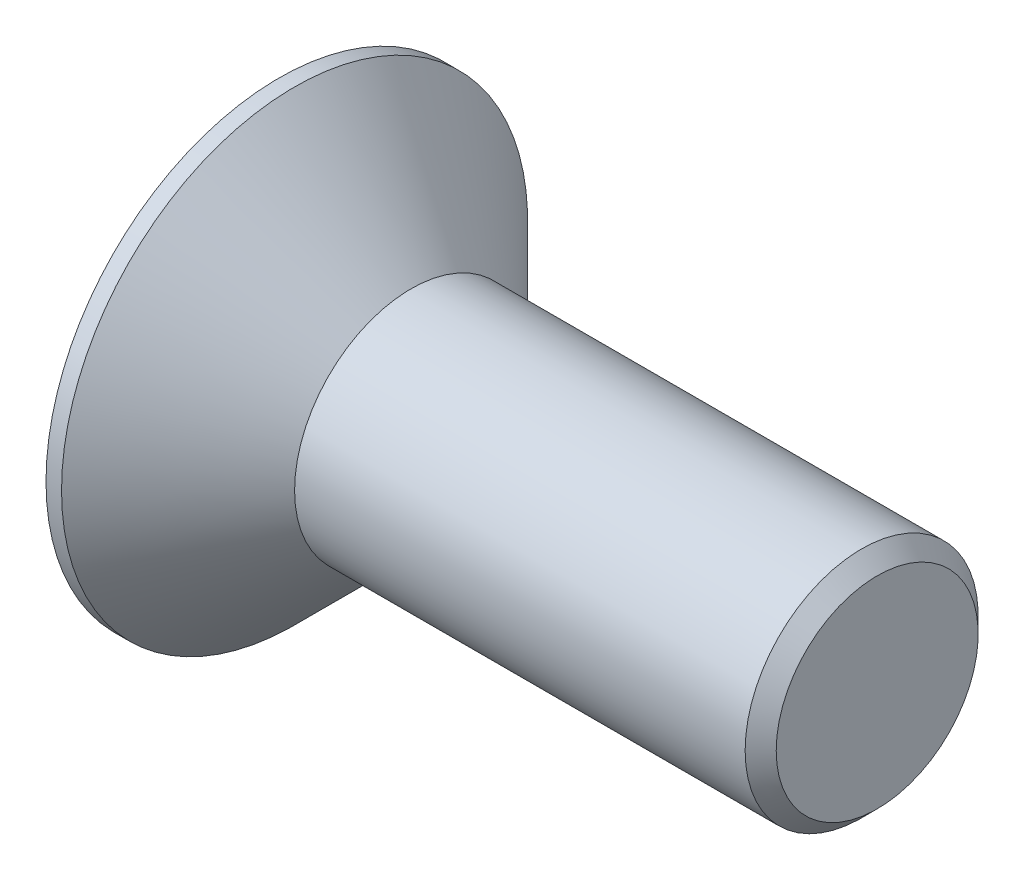
ISO-10303-21;
HEADER;
FILE_DESCRIPTION(('STEP AP214'),'2;1');
FILE_NAME('part.step','',(''),(''),'','','');
FILE_SCHEMA(('AUTOMOTIVE_DESIGN { 1 0 10303 214 1 1 1 1 }'));
ENDSEC;
DATA;
#1=APPLICATION_CONTEXT('core data for automotive mechanical design processes');
#2=APPLICATION_PROTOCOL_DEFINITION('international standard','automotive_design',2000,#1);
#3=PRODUCT_CONTEXT('',#1,'mechanical');
#4=PRODUCT('Part','Part','',(#3));
#5=PRODUCT_RELATED_PRODUCT_CATEGORY('part','',(#4));
#6=PRODUCT_DEFINITION_FORMATION('','',#4);
#7=PRODUCT_DEFINITION_CONTEXT('part definition',#1,'design');
#8=PRODUCT_DEFINITION('design','',#6,#7);
#9=PRODUCT_DEFINITION_SHAPE('','',#8);
#10=(LENGTH_UNIT() NAMED_UNIT(*) SI_UNIT(.MILLI.,.METRE.));
#11=(NAMED_UNIT(*) PLANE_ANGLE_UNIT() SI_UNIT($,.RADIAN.));
#12=(NAMED_UNIT(*) SI_UNIT($,.STERADIAN.) SOLID_ANGLE_UNIT());
#13=UNCERTAINTY_MEASURE_WITH_UNIT(LENGTH_MEASURE(1.E-05),#10,'distance_accuracy_value','');
#14=(GEOMETRIC_REPRESENTATION_CONTEXT(3) GLOBAL_UNCERTAINTY_ASSIGNED_CONTEXT((#13)) GLOBAL_UNIT_ASSIGNED_CONTEXT((#10,
#11,#12)) REPRESENTATION_CONTEXT('',''));
#15=CARTESIAN_POINT('',(0.,0.,0.));
#16=DIRECTION('',(0.,0.,1.));
#17=DIRECTION('',(1.,0.,0.));
#18=AXIS2_PLACEMENT_3D('',#15,#16,#17);
#19=CARTESIAN_POINT('',(0.,0.,0.));
#20=DIRECTION('',(1.,0.,0.));
#21=DIRECTION('',(0.,0.,-1.));
#22=AXIS2_PLACEMENT_3D('',#19,#20,#21);
#23=PLANE('',#22);
#24=DIRECTION('',(0.,0.866025403784439,0.5));
#25=VECTOR('',#24,1.);
#26=CARTESIAN_POINT('',(0.,-0.75,0.433012701892219));
#27=LINE('',#26,#25);
#28=CARTESIAN_POINT('',(0.,-0.75,0.433012701892219));
#29=VERTEX_POINT('',#28);
#30=CARTESIAN_POINT('',(0.,0.,0.866025403784438));
#31=VERTEX_POINT('',#30);
#32=EDGE_CURVE('E121',#29,#31,#27,.T.);
#33=ORIENTED_EDGE('',*,*,#32,.F.);
#34=DIRECTION('',(0.,0.,1.));
#35=VECTOR('',#34,1.);
#36=CARTESIAN_POINT('',(0.,-0.75,-0.433012701892219));
#37=LINE('',#36,#35);
#38=CARTESIAN_POINT('',(0.,-0.75,-0.433012701892219));
#39=VERTEX_POINT('',#38);
#40=EDGE_CURVE('E47',#39,#29,#37,.T.);
#41=ORIENTED_EDGE('',*,*,#40,.F.);
#42=DIRECTION('',(0.,-0.866025403784438,0.5));
#43=VECTOR('',#42,1.);
#44=CARTESIAN_POINT('',(0.,0.,-0.866025403784439));
#45=LINE('',#44,#43);
#46=CARTESIAN_POINT('',(0.,0.,-0.866025403784439));
#47=VERTEX_POINT('',#46);
#48=EDGE_CURVE('E130',#47,#39,#45,.T.);
#49=ORIENTED_EDGE('',*,*,#48,.F.);
#50=DIRECTION('',(0.,-0.866025403784438,-0.5));
#51=VECTOR('',#50,1.);
#52=CARTESIAN_POINT('',(0.,0.75,-0.433012701892219));
#53=LINE('',#52,#51);
#54=CARTESIAN_POINT('',(0.,0.75,-0.433012701892219));
#55=VERTEX_POINT('',#54);
#56=EDGE_CURVE('E128',#55,#47,#53,.T.);
#57=ORIENTED_EDGE('',*,*,#56,.F.);
#58=DIRECTION('',(0.,0.,-1.));
#59=VECTOR('',#58,1.);
#60=CARTESIAN_POINT('',(0.,0.75,0.433012701892219));
#61=LINE('',#60,#59);
#62=CARTESIAN_POINT('',(0.,0.75,0.433012701892219));
#63=VERTEX_POINT('',#62);
#64=EDGE_CURVE('E95',#63,#55,#61,.T.);
#65=ORIENTED_EDGE('',*,*,#64,.F.);
#66=DIRECTION('',(0.,0.866025403784438,-0.5));
#67=VECTOR('',#66,1.);
#68=CARTESIAN_POINT('',(0.,0.,0.866025403784438));
#69=LINE('',#68,#67);
#70=EDGE_CURVE('E124',#31,#63,#69,.T.);
#71=ORIENTED_EDGE('',*,*,#70,.F.);
#72=EDGE_LOOP('',(#33,#41,#49,#57,#65,#71));
#73=FACE_BOUND('',#72,.T.);
#74=CARTESIAN_POINT('',(0.,0.,0.));
#75=DIRECTION('',(-1.,0.,0.));
#76=DIRECTION('',(0.,0.,1.));
#77=AXIS2_PLACEMENT_3D('',#74,#75,#76);
#78=CIRCLE('',#77,3.);
#79=CARTESIAN_POINT('',(0.,0.,3.));
#80=VERTEX_POINT('',#79);
#81=EDGE_CURVE('E145',#80,#80,#78,.T.);
#82=ORIENTED_EDGE('',*,*,#81,.T.);
#83=EDGE_LOOP('',(#82));
#84=FACE_BOUND('',#83,.T.);
#85=ADVANCED_FACE('F32',(#73,#84),#23,.F.);
#86=CARTESIAN_POINT('',(0.,0.,0.));
#87=DIRECTION('',(-1.,0.,0.));
#88=DIRECTION('',(0.,0.,1.));
#89=AXIS2_PLACEMENT_3D('',#86,#87,#88);
#90=CYLINDRICAL_SURFACE('',#89,3.);
#91=ORIENTED_EDGE('',*,*,#81,.F.);
#92=EDGE_LOOP('',(#91));
#93=FACE_BOUND('',#92,.T.);
#94=CARTESIAN_POINT('',(0.2,0.,0.));
#95=DIRECTION('',(-1.,0.,0.));
#96=DIRECTION('',(0.,0.,1.));
#97=AXIS2_PLACEMENT_3D('',#94,#95,#96);
#98=CIRCLE('',#97,3.);
#99=CARTESIAN_POINT('',(0.2,0.,3.));
#100=VERTEX_POINT('',#99);
#101=EDGE_CURVE('E142',#100,#100,#98,.T.);
#102=ORIENTED_EDGE('',*,*,#101,.T.);
#103=EDGE_LOOP('',(#102));
#104=FACE_BOUND('',#103,.T.);
#105=ADVANCED_FACE('F162',(#93,#104),#90,.T.);
#106=CARTESIAN_POINT('',(1.69999999999999,0.,0.));
#107=DIRECTION('',(-1.,0.,0.));
#108=DIRECTION('',(0.,0.,1.));
#109=AXIS2_PLACEMENT_3D('',#106,#107,#108);
#110=CONICAL_SURFACE('',#109,1.5,0.785398163397453);
#111=ORIENTED_EDGE('',*,*,#101,.F.);
#112=EDGE_LOOP('',(#111));
#113=FACE_BOUND('',#112,.T.);
#114=CARTESIAN_POINT('',(1.69999999999999,0.,0.));
#115=DIRECTION('',(-1.,0.,0.));
#116=DIRECTION('',(0.,0.,1.));
#117=AXIS2_PLACEMENT_3D('',#114,#115,#116);
#118=CIRCLE('',#117,1.5);
#119=CARTESIAN_POINT('',(1.69999999999999,0.,1.5));
#120=VERTEX_POINT('',#119);
#121=EDGE_CURVE('E134',#120,#120,#118,.T.);
#122=ORIENTED_EDGE('',*,*,#121,.T.);
#123=EDGE_LOOP('',(#122));
#124=FACE_BOUND('',#123,.T.);
#125=ADVANCED_FACE('F167',(#113,#124),#110,.T.);
#126=CARTESIAN_POINT('',(0.,0.,0.));
#127=DIRECTION('',(-1.,0.,0.));
#128=DIRECTION('',(0.,0.,1.));
#129=AXIS2_PLACEMENT_3D('',#126,#127,#128);
#130=CYLINDRICAL_SURFACE('',#129,1.5);
#131=CARTESIAN_POINT('',(7.49999999999999,0.,0.));
#132=DIRECTION('',(-1.,0.,0.));
#133=DIRECTION('',(0.,0.,1.));
#134=AXIS2_PLACEMENT_3D('',#131,#132,#133);
#135=CIRCLE('',#134,1.5);
#136=CARTESIAN_POINT('',(7.49999999999999,0.,1.5));
#137=VERTEX_POINT('',#136);
#138=EDGE_CURVE('E40',#137,#137,#135,.T.);
#139=ORIENTED_EDGE('',*,*,#138,.T.);
#140=EDGE_LOOP('',(#139));
#141=FACE_BOUND('',#140,.T.);
#142=ORIENTED_EDGE('',*,*,#121,.F.);
#143=EDGE_LOOP('',(#142));
#144=FACE_BOUND('',#143,.T.);
#145=ADVANCED_FACE('F150',(#141,#144),#130,.T.);
#146=CARTESIAN_POINT('',(7.69999999999999,1.5,0.));
#147=DIRECTION('',(-1.,0.,0.));
#148=DIRECTION('',(0.,0.,1.));
#149=AXIS2_PLACEMENT_3D('',#146,#147,#148);
#150=PLANE('',#149);
#151=CARTESIAN_POINT('',(7.69999999999999,0.,0.));
#152=DIRECTION('',(-1.,0.,0.));
#153=DIRECTION('',(0.,0.,1.));
#154=AXIS2_PLACEMENT_3D('',#151,#152,#153);
#155=CIRCLE('',#154,1.3);
#156=CARTESIAN_POINT('',(7.69999999999999,0.,1.3));
#157=VERTEX_POINT('',#156);
#158=EDGE_CURVE('E11',#157,#157,#155,.F.);
#159=ORIENTED_EDGE('',*,*,#158,.T.);
#160=EDGE_LOOP('',(#159));
#161=FACE_BOUND('',#160,.T.);
#162=ADVANCED_FACE('F178',(#161),#150,.F.);
#163=CARTESIAN_POINT('',(2.,-0.75,-0.433012701892219));
#164=DIRECTION('',(0.,-1.,0.));
#165=DIRECTION('',(0.,0.,-1.));
#166=AXIS2_PLACEMENT_3D('',#163,#164,#165);
#167=PLANE('',#166);
#168=ORIENTED_EDGE('',*,*,#40,.T.);
#169=DIRECTION('',(-1.,0.,0.));
#170=VECTOR('',#169,1.);
#171=CARTESIAN_POINT('',(2.,-0.75,0.433012701892219));
#172=LINE('',#171,#170);
#173=CARTESIAN_POINT('',(2.,-0.75,0.433012701892219));
#174=VERTEX_POINT('',#173);
#175=EDGE_CURVE('E77',#174,#29,#172,.T.);
#176=ORIENTED_EDGE('',*,*,#175,.F.);
#177=DIRECTION('',(0.,0.,1.));
#178=VECTOR('',#177,1.);
#179=CARTESIAN_POINT('',(2.,-0.75,-0.433012701892219));
#180=LINE('',#179,#178);
#181=CARTESIAN_POINT('',(2.,-0.75,-0.433012701892219));
#182=VERTEX_POINT('',#181);
#183=EDGE_CURVE('E132',#182,#174,#180,.T.);
#184=ORIENTED_EDGE('',*,*,#183,.F.);
#185=DIRECTION('',(-1.,0.,0.));
#186=VECTOR('',#185,1.);
#187=CARTESIAN_POINT('',(2.,-0.75,-0.433012701892219));
#188=LINE('',#187,#186);
#189=EDGE_CURVE('E55',#182,#39,#188,.T.);
#190=ORIENTED_EDGE('',*,*,#189,.T.);
#191=EDGE_LOOP('',(#168,#176,#184,#190));
#192=FACE_BOUND('',#191,.T.);
#193=ADVANCED_FACE('F181',(#192),#167,.F.);
#194=CARTESIAN_POINT('',(2.,0.,-0.866025403784439));
#195=DIRECTION('',(0.,-0.5,-0.866025403784438));
#196=DIRECTION('',(0.,0.866025403784439,-0.5));
#197=AXIS2_PLACEMENT_3D('',#194,#195,#196);
#198=PLANE('',#197);
#199=ORIENTED_EDGE('',*,*,#48,.T.);
#200=ORIENTED_EDGE('',*,*,#189,.F.);
#201=DIRECTION('',(0.,-0.866025403784438,0.5));
#202=VECTOR('',#201,1.);
#203=CARTESIAN_POINT('',(2.,0.,-0.866025403784439));
#204=LINE('',#203,#202);
#205=CARTESIAN_POINT('',(2.,0.,-0.866025403784439));
#206=VERTEX_POINT('',#205);
#207=EDGE_CURVE('E107',#206,#182,#204,.T.);
#208=ORIENTED_EDGE('',*,*,#207,.F.);
#209=DIRECTION('',(-1.,0.,0.));
#210=VECTOR('',#209,1.);
#211=CARTESIAN_POINT('',(2.,0.,-0.866025403784439));
#212=LINE('',#211,#210);
#213=EDGE_CURVE('E99',#206,#47,#212,.T.);
#214=ORIENTED_EDGE('',*,*,#213,.T.);
#215=EDGE_LOOP('',(#199,#200,#208,#214));
#216=FACE_BOUND('',#215,.T.);
#217=ADVANCED_FACE('F185',(#216),#198,.F.);
#218=CARTESIAN_POINT('',(2.,0.75,-0.433012701892219));
#219=DIRECTION('',(0.,0.5,-0.866025403784439));
#220=DIRECTION('',(0.,0.866025403784438,0.5));
#221=AXIS2_PLACEMENT_3D('',#218,#219,#220);
#222=PLANE('',#221);
#223=ORIENTED_EDGE('',*,*,#56,.T.);
#224=ORIENTED_EDGE('',*,*,#213,.F.);
#225=DIRECTION('',(0.,-0.866025403784438,-0.5));
#226=VECTOR('',#225,1.);
#227=CARTESIAN_POINT('',(2.,0.75,-0.433012701892219));
#228=LINE('',#227,#226);
#229=CARTESIAN_POINT('',(2.,0.75,-0.433012701892219));
#230=VERTEX_POINT('',#229);
#231=EDGE_CURVE('E103',#230,#206,#228,.T.);
#232=ORIENTED_EDGE('',*,*,#231,.F.);
#233=DIRECTION('',(-1.,0.,0.));
#234=VECTOR('',#233,1.);
#235=CARTESIAN_POINT('',(2.,0.75,-0.433012701892219));
#236=LINE('',#235,#234);
#237=EDGE_CURVE('E88',#230,#55,#236,.T.);
#238=ORIENTED_EDGE('',*,*,#237,.T.);
#239=EDGE_LOOP('',(#223,#224,#232,#238));
#240=FACE_BOUND('',#239,.T.);
#241=ADVANCED_FACE('F104',(#240),#222,.F.);
#242=CARTESIAN_POINT('',(2.,0.75,0.433012701892219));
#243=DIRECTION('',(0.,1.,0.));
#244=DIRECTION('',(0.,0.,1.));
#245=AXIS2_PLACEMENT_3D('',#242,#243,#244);
#246=PLANE('',#245);
#247=ORIENTED_EDGE('',*,*,#64,.T.);
#248=ORIENTED_EDGE('',*,*,#237,.F.);
#249=DIRECTION('',(0.,0.,-1.));
#250=VECTOR('',#249,1.);
#251=CARTESIAN_POINT('',(2.,0.75,0.433012701892219));
#252=LINE('',#251,#250);
#253=CARTESIAN_POINT('',(2.,0.75,0.433012701892219));
#254=VERTEX_POINT('',#253);
#255=EDGE_CURVE('E92',#254,#230,#252,.T.);
#256=ORIENTED_EDGE('',*,*,#255,.F.);
#257=DIRECTION('',(-1.,0.,0.));
#258=VECTOR('',#257,1.);
#259=CARTESIAN_POINT('',(2.,0.75,0.433012701892219));
#260=LINE('',#259,#258);
#261=EDGE_CURVE('E100',#254,#63,#260,.T.);
#262=ORIENTED_EDGE('',*,*,#261,.T.);
#263=EDGE_LOOP('',(#247,#248,#256,#262));
#264=FACE_BOUND('',#263,.T.);
#265=ADVANCED_FACE('F90',(#264),#246,.F.);
#266=CARTESIAN_POINT('',(2.,0.,0.866025403784438));
#267=DIRECTION('',(0.,0.5,0.866025403784439));
#268=DIRECTION('',(0.,-0.866025403784438,0.5));
#269=AXIS2_PLACEMENT_3D('',#266,#267,#268);
#270=PLANE('',#269);
#271=ORIENTED_EDGE('',*,*,#70,.T.);
#272=ORIENTED_EDGE('',*,*,#261,.F.);
#273=DIRECTION('',(0.,0.866025403784438,-0.5));
#274=VECTOR('',#273,1.);
#275=CARTESIAN_POINT('',(2.,0.,0.866025403784438));
#276=LINE('',#275,#274);
#277=CARTESIAN_POINT('',(2.,0.,0.866025403784438));
#278=VERTEX_POINT('',#277);
#279=EDGE_CURVE('E113',#278,#254,#276,.T.);
#280=ORIENTED_EDGE('',*,*,#279,.F.);
#281=DIRECTION('',(-1.,0.,0.));
#282=VECTOR('',#281,1.);
#283=CARTESIAN_POINT('',(2.,0.,0.866025403784438));
#284=LINE('',#283,#282);
#285=EDGE_CURVE('E137',#278,#31,#284,.T.);
#286=ORIENTED_EDGE('',*,*,#285,.T.);
#287=EDGE_LOOP('',(#271,#272,#280,#286));
#288=FACE_BOUND('',#287,.T.);
#289=ADVANCED_FACE('F188',(#288),#270,.F.);
#290=CARTESIAN_POINT('',(2.,-0.75,0.433012701892219));
#291=DIRECTION('',(0.,-0.5,0.866025403784439));
#292=DIRECTION('',(0.,-0.866025403784439,-0.5));
#293=AXIS2_PLACEMENT_3D('',#290,#291,#292);
#294=PLANE('',#293);
#295=ORIENTED_EDGE('',*,*,#32,.T.);
#296=ORIENTED_EDGE('',*,*,#285,.F.);
#297=DIRECTION('',(0.,0.866025403784439,0.5));
#298=VECTOR('',#297,1.);
#299=CARTESIAN_POINT('',(2.,-0.75,0.433012701892219));
#300=LINE('',#299,#298);
#301=EDGE_CURVE('E115',#174,#278,#300,.T.);
#302=ORIENTED_EDGE('',*,*,#301,.F.);
#303=ORIENTED_EDGE('',*,*,#175,.T.);
#304=EDGE_LOOP('',(#295,#296,#302,#303));
#305=FACE_BOUND('',#304,.T.);
#306=ADVANCED_FACE('F158',(#305),#294,.F.);
#307=CARTESIAN_POINT('',(2.,0.,0.));
#308=DIRECTION('',(-1.,0.,0.));
#309=DIRECTION('',(0.,0.,1.));
#310=AXIS2_PLACEMENT_3D('',#307,#308,#309);
#311=PLANE('',#310);
#312=ORIENTED_EDGE('',*,*,#183,.T.);
#313=ORIENTED_EDGE('',*,*,#301,.T.);
#314=ORIENTED_EDGE('',*,*,#279,.T.);
#315=ORIENTED_EDGE('',*,*,#255,.T.);
#316=ORIENTED_EDGE('',*,*,#231,.T.);
#317=ORIENTED_EDGE('',*,*,#207,.T.);
#318=EDGE_LOOP('',(#312,#313,#314,#315,#316,#317));
#319=FACE_BOUND('',#318,.T.);
#320=ADVANCED_FACE('F110',(#319),#311,.T.);
#321=CARTESIAN_POINT('',(7.49999999999999,0.,0.));
#322=DIRECTION('',(-1.,0.,0.));
#323=DIRECTION('',(0.,0.,1.));
#324=AXIS2_PLACEMENT_3D('',#321,#322,#323);
#325=CONICAL_SURFACE('',#324,1.5,0.785398163397452);
#326=ORIENTED_EDGE('',*,*,#158,.F.);
#327=EDGE_LOOP('',(#326));
#328=FACE_BOUND('',#327,.T.);
#329=ORIENTED_EDGE('',*,*,#138,.F.);
#330=EDGE_LOOP('',(#329));
#331=FACE_BOUND('',#330,.T.);
#332=ADVANCED_FACE('F34',(#328,#331),#325,.T.);
#333=CLOSED_SHELL('',(#85,#105,#125,#145,#162,#193,#217,#241,#265,#289,#306,#320,#332));
#334=MANIFOLD_SOLID_BREP('B2',#333);
#335=ADVANCED_BREP_SHAPE_REPRESENTATION('',(#18,#334),#14);
#336=SHAPE_DEFINITION_REPRESENTATION(#9,#335);
ENDSEC;
END-ISO-10303-21;
